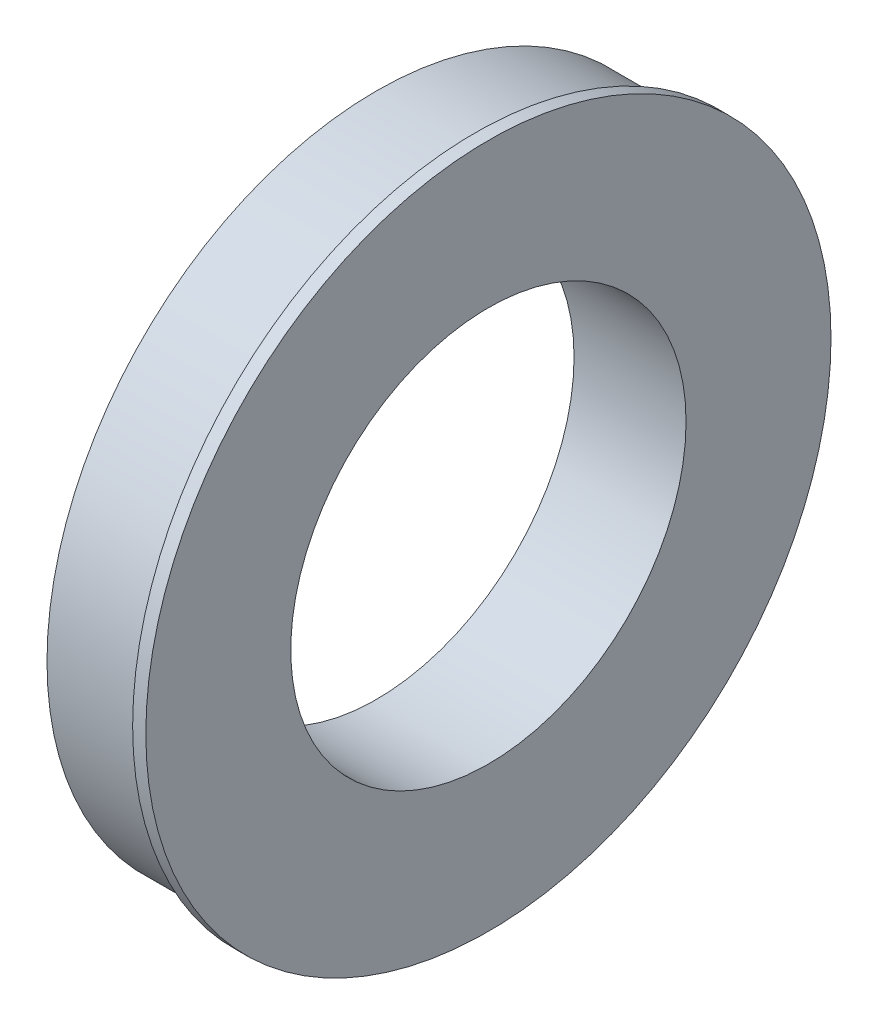
ISO-10303-21;
HEADER;
FILE_DESCRIPTION(('STEP AP214'),'2;1');
FILE_NAME('part.step','',(''),(''),'','','');
FILE_SCHEMA(('AUTOMOTIVE_DESIGN { 1 0 10303 214 1 1 1 1 }'));
ENDSEC;
DATA;
#1=APPLICATION_CONTEXT('core data for automotive mechanical design processes');
#2=APPLICATION_PROTOCOL_DEFINITION('international standard','automotive_design',2000,#1);
#3=PRODUCT_CONTEXT('',#1,'mechanical');
#4=PRODUCT('Part','Part','',(#3));
#5=PRODUCT_RELATED_PRODUCT_CATEGORY('part','',(#4));
#6=PRODUCT_DEFINITION_FORMATION('','',#4);
#7=PRODUCT_DEFINITION_CONTEXT('part definition',#1,'design');
#8=PRODUCT_DEFINITION('design','',#6,#7);
#9=PRODUCT_DEFINITION_SHAPE('','',#8);
#10=(LENGTH_UNIT() NAMED_UNIT(*) SI_UNIT(.MILLI.,.METRE.));
#11=(NAMED_UNIT(*) PLANE_ANGLE_UNIT() SI_UNIT($,.RADIAN.));
#12=(NAMED_UNIT(*) SI_UNIT($,.STERADIAN.) SOLID_ANGLE_UNIT());
#13=UNCERTAINTY_MEASURE_WITH_UNIT(LENGTH_MEASURE(1.E-05),#10,'distance_accuracy_value','');
#14=(GEOMETRIC_REPRESENTATION_CONTEXT(3) GLOBAL_UNCERTAINTY_ASSIGNED_CONTEXT((#13)) GLOBAL_UNIT_ASSIGNED_CONTEXT((#10,
#11,#12)) REPRESENTATION_CONTEXT('',''));
#15=CARTESIAN_POINT('',(0.,0.,0.));
#16=DIRECTION('',(0.,0.,1.));
#17=DIRECTION('',(1.,0.,0.));
#18=AXIS2_PLACEMENT_3D('',#15,#16,#17);
#19=CARTESIAN_POINT('',(0.,0.,0.));
#20=DIRECTION('',(1.,0.,0.));
#21=DIRECTION('',(0.,0.,-1.));
#22=AXIS2_PLACEMENT_3D('',#19,#20,#21);
#23=PLANE('',#22);
#24=CARTESIAN_POINT('',(0.,0.,0.));
#25=DIRECTION('',(1.,0.,0.));
#26=DIRECTION('',(0.,0.,-1.));
#27=AXIS2_PLACEMENT_3D('',#24,#25,#26);
#28=CIRCLE('',#27,63.5);
#29=CARTESIAN_POINT('',(0.,0.,-63.5));
#30=VERTEX_POINT('',#29);
#31=EDGE_CURVE('E43',#30,#30,#28,.T.);
#32=ORIENTED_EDGE('',*,*,#31,.F.);
#33=EDGE_LOOP('',(#32));
#34=FACE_BOUND('',#33,.T.);
#35=CARTESIAN_POINT('',(0.,0.,0.));
#36=DIRECTION('',(1.,0.,0.));
#37=DIRECTION('',(0.,0.,-1.));
#38=AXIS2_PLACEMENT_3D('',#35,#36,#37);
#39=CIRCLE('',#38,38.1);
#40=CARTESIAN_POINT('',(0.,0.,-38.1));
#41=VERTEX_POINT('',#40);
#42=EDGE_CURVE('E50',#41,#41,#39,.T.);
#43=ORIENTED_EDGE('',*,*,#42,.T.);
#44=EDGE_LOOP('',(#43));
#45=FACE_BOUND('',#44,.T.);
#46=ADVANCED_FACE('F39',(#34,#45),#23,.F.);
#47=CARTESIAN_POINT('',(19.05,0.,0.));
#48=DIRECTION('',(-1.,0.,0.));
#49=DIRECTION('',(0.,0.,1.));
#50=AXIS2_PLACEMENT_3D('',#47,#48,#49);
#51=CYLINDRICAL_SURFACE('',#50,63.5);
#52=CARTESIAN_POINT('',(19.05,0.,0.));
#53=DIRECTION('',(1.,0.,0.));
#54=DIRECTION('',(0.,0.,-1.));
#55=AXIS2_PLACEMENT_3D('',#52,#53,#54);
#56=CIRCLE('',#55,63.5);
#57=CARTESIAN_POINT('',(19.05,0.,-63.5));
#58=VERTEX_POINT('',#57);
#59=EDGE_CURVE('E10',#58,#58,#56,.T.);
#60=ORIENTED_EDGE('',*,*,#59,.F.);
#61=EDGE_LOOP('',(#60));
#62=FACE_BOUND('',#61,.T.);
#63=ORIENTED_EDGE('',*,*,#31,.T.);
#64=EDGE_LOOP('',(#63));
#65=FACE_BOUND('',#64,.T.);
#66=ADVANCED_FACE('F41',(#62,#65),#51,.T.);
#67=CARTESIAN_POINT('',(19.05,0.,0.));
#68=DIRECTION('',(-1.,0.,0.));
#69=DIRECTION('',(0.,0.,1.));
#70=AXIS2_PLACEMENT_3D('',#67,#68,#69);
#71=CYLINDRICAL_SURFACE('',#70,38.1);
#72=ORIENTED_EDGE('',*,*,#42,.F.);
#73=EDGE_LOOP('',(#72));
#74=FACE_BOUND('',#73,.T.);
#75=CARTESIAN_POINT('',(21.59,0.,0.));
#76=DIRECTION('',(1.,0.,0.));
#77=DIRECTION('',(0.,0.,-1.));
#78=AXIS2_PLACEMENT_3D('',#75,#76,#77);
#79=CIRCLE('',#78,38.1);
#80=CARTESIAN_POINT('',(21.59,0.,-38.1));
#81=VERTEX_POINT('',#80);
#82=EDGE_CURVE('E58',#81,#81,#79,.T.);
#83=ORIENTED_EDGE('',*,*,#82,.T.);
#84=EDGE_LOOP('',(#83));
#85=FACE_BOUND('',#84,.T.);
#86=ADVANCED_FACE('F64',(#74,#85),#71,.F.);
#87=CARTESIAN_POINT('',(21.59,0.,0.));
#88=DIRECTION('',(1.,0.,0.));
#89=DIRECTION('',(0.,0.,-1.));
#90=AXIS2_PLACEMENT_3D('',#87,#88,#89);
#91=PLANE('',#90);
#92=CARTESIAN_POINT('',(21.59,0.,0.));
#93=DIRECTION('',(1.,0.,0.));
#94=DIRECTION('',(0.,0.,-1.));
#95=AXIS2_PLACEMENT_3D('',#92,#93,#94);
#96=CIRCLE('',#95,66.04);
#97=CARTESIAN_POINT('',(21.59,0.,-66.04));
#98=VERTEX_POINT('',#97);
#99=EDGE_CURVE('E54',#98,#98,#96,.T.);
#100=ORIENTED_EDGE('',*,*,#99,.T.);
#101=EDGE_LOOP('',(#100));
#102=FACE_BOUND('',#101,.T.);
#103=ORIENTED_EDGE('',*,*,#82,.F.);
#104=EDGE_LOOP('',(#103));
#105=FACE_BOUND('',#104,.T.);
#106=ADVANCED_FACE('F66',(#102,#105),#91,.T.);
#107=CARTESIAN_POINT('',(19.05,0.,0.));
#108=DIRECTION('',(1.,0.,0.));
#109=DIRECTION('',(0.,0.,-1.));
#110=AXIS2_PLACEMENT_3D('',#107,#108,#109);
#111=PLANE('',#110);
#112=ORIENTED_EDGE('',*,*,#59,.T.);
#113=EDGE_LOOP('',(#112));
#114=FACE_BOUND('',#113,.T.);
#115=CARTESIAN_POINT('',(19.05,0.,0.));
#116=DIRECTION('',(1.,0.,0.));
#117=DIRECTION('',(0.,0.,-1.));
#118=AXIS2_PLACEMENT_3D('',#115,#116,#117);
#119=CIRCLE('',#118,66.04);
#120=CARTESIAN_POINT('',(19.05,0.,-66.04));
#121=VERTEX_POINT('',#120);
#122=EDGE_CURVE('E55',#121,#121,#119,.T.);
#123=ORIENTED_EDGE('',*,*,#122,.F.);
#124=EDGE_LOOP('',(#123));
#125=FACE_BOUND('',#124,.T.);
#126=ADVANCED_FACE('F68',(#114,#125),#111,.F.);
#127=CARTESIAN_POINT('',(21.59,0.,0.));
#128=DIRECTION('',(-1.,0.,0.));
#129=DIRECTION('',(0.,0.,1.));
#130=AXIS2_PLACEMENT_3D('',#127,#128,#129);
#131=CYLINDRICAL_SURFACE('',#130,66.04);
#132=ORIENTED_EDGE('',*,*,#99,.F.);
#133=EDGE_LOOP('',(#132));
#134=FACE_BOUND('',#133,.T.);
#135=ORIENTED_EDGE('',*,*,#122,.T.);
#136=EDGE_LOOP('',(#135));
#137=FACE_BOUND('',#136,.T.);
#138=ADVANCED_FACE('F75',(#134,#137),#131,.T.);
#139=CLOSED_SHELL('',(#46,#66,#86,#106,#126,#138));
#140=MANIFOLD_SOLID_BREP('B2',#139);
#141=ADVANCED_BREP_SHAPE_REPRESENTATION('',(#18,#140),#14);
#142=SHAPE_DEFINITION_REPRESENTATION(#9,#141);
ENDSEC;
END-ISO-10303-21;
